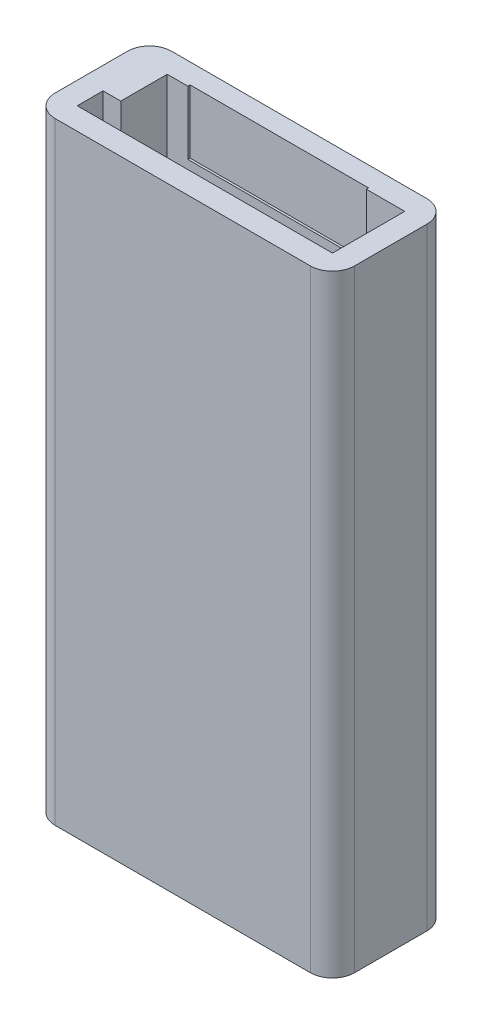
ISO-10303-21;
HEADER;
FILE_DESCRIPTION(('STEP AP214'),'2;1');
FILE_NAME('part.step','',(''),(''),'','','');
FILE_SCHEMA(('AUTOMOTIVE_DESIGN { 1 0 10303 214 1 1 1 1 }'));
ENDSEC;
DATA;
#1=APPLICATION_CONTEXT('core data for automotive mechanical design processes');
#2=APPLICATION_PROTOCOL_DEFINITION('international standard','automotive_design',2000,#1);
#3=PRODUCT_CONTEXT('',#1,'mechanical');
#4=PRODUCT('Part','Part','',(#3));
#5=PRODUCT_RELATED_PRODUCT_CATEGORY('part','',(#4));
#6=PRODUCT_DEFINITION_FORMATION('','',#4);
#7=PRODUCT_DEFINITION_CONTEXT('part definition',#1,'design');
#8=PRODUCT_DEFINITION('design','',#6,#7);
#9=PRODUCT_DEFINITION_SHAPE('','',#8);
#10=(LENGTH_UNIT() NAMED_UNIT(*) SI_UNIT(.MILLI.,.METRE.));
#11=(NAMED_UNIT(*) PLANE_ANGLE_UNIT() SI_UNIT($,.RADIAN.));
#12=(NAMED_UNIT(*) SI_UNIT($,.STERADIAN.) SOLID_ANGLE_UNIT());
#13=UNCERTAINTY_MEASURE_WITH_UNIT(LENGTH_MEASURE(1.E-05),#10,'distance_accuracy_value','');
#14=(GEOMETRIC_REPRESENTATION_CONTEXT(3) GLOBAL_UNCERTAINTY_ASSIGNED_CONTEXT((#13)) GLOBAL_UNIT_ASSIGNED_CONTEXT((#10,
#11,#12)) REPRESENTATION_CONTEXT('',''));
#15=CARTESIAN_POINT('',(0.,0.,0.));
#16=DIRECTION('',(0.,0.,1.));
#17=DIRECTION('',(1.,0.,0.));
#18=AXIS2_PLACEMENT_3D('',#15,#16,#17);
#19=CARTESIAN_POINT('',(8.65,41.5,-2.45));
#20=DIRECTION('',(0.,0.,1.));
#21=DIRECTION('',(1.,0.,0.));
#22=AXIS2_PLACEMENT_3D('',#19,#20,#21);
#23=PLANE('',#22);
#24=DIRECTION('',(0.,-1.,0.));
#25=VECTOR('',#24,1.);
#26=CARTESIAN_POINT('',(-6.05,41.5,-2.45));
#27=LINE('',#26,#25);
#28=CARTESIAN_POINT('',(-6.05,41.5,-2.45));
#29=VERTEX_POINT('',#28);
#30=CARTESIAN_POINT('',(-6.05,37.2,-2.45));
#31=VERTEX_POINT('',#30);
#32=EDGE_CURVE('E219',#29,#31,#27,.T.);
#33=ORIENTED_EDGE('',*,*,#32,.F.);
#34=DIRECTION('',(-1.,0.,0.));
#35=VECTOR('',#34,1.);
#36=CARTESIAN_POINT('',(8.65,41.5,-2.45));
#37=LINE('',#36,#35);
#38=CARTESIAN_POINT('',(-7.45,41.5,-2.45));
#39=VERTEX_POINT('',#38);
#40=EDGE_CURVE('E276',#29,#39,#37,.T.);
#41=ORIENTED_EDGE('',*,*,#40,.T.);
#42=DIRECTION('',(0.,-1.,0.));
#43=VECTOR('',#42,1.);
#44=CARTESIAN_POINT('',(-7.45,44.8708307581366,-2.45));
#45=LINE('',#44,#43);
#46=CARTESIAN_POINT('',(-7.45,1.5,-2.45));
#47=VERTEX_POINT('',#46);
#48=EDGE_CURVE('E256',#39,#47,#45,.T.);
#49=ORIENTED_EDGE('',*,*,#48,.T.);
#50=DIRECTION('',(-1.,0.,0.));
#51=VECTOR('',#50,1.);
#52=CARTESIAN_POINT('',(8.65,1.5,-2.45));
#53=LINE('',#52,#51);
#54=CARTESIAN_POINT('',(7.45,1.5,-2.45));
#55=VERTEX_POINT('',#54);
#56=EDGE_CURVE('E196',#55,#47,#53,.T.);
#57=ORIENTED_EDGE('',*,*,#56,.F.);
#58=DIRECTION('',(0.,-1.,0.));
#59=VECTOR('',#58,1.);
#60=CARTESIAN_POINT('',(7.45,18.5,-2.45));
#61=LINE('',#60,#59);
#62=CARTESIAN_POINT('',(7.45,18.5,-2.45));
#63=VERTEX_POINT('',#62);
#64=EDGE_CURVE('E241',#63,#55,#61,.T.);
#65=ORIENTED_EDGE('',*,*,#64,.F.);
#66=DIRECTION('',(-1.,0.,0.));
#67=VECTOR('',#66,1.);
#68=CARTESIAN_POINT('',(8.65,18.5,-2.45));
#69=LINE('',#68,#67);
#70=CARTESIAN_POINT('',(8.65,18.5,-2.45));
#71=VERTEX_POINT('',#70);
#72=EDGE_CURVE('E225',#71,#63,#69,.T.);
#73=ORIENTED_EDGE('',*,*,#72,.F.);
#74=DIRECTION('',(0.,-1.,0.));
#75=VECTOR('',#74,1.);
#76=CARTESIAN_POINT('',(8.65,41.5,-2.45));
#77=LINE('',#76,#75);
#78=CARTESIAN_POINT('',(8.65,41.5,-2.45));
#79=VERTEX_POINT('',#78);
#80=EDGE_CURVE('E279',#79,#71,#77,.T.);
#81=ORIENTED_EDGE('',*,*,#80,.F.);
#82=CARTESIAN_POINT('',(6.05,41.5,-2.45));
#83=VERTEX_POINT('',#82);
#84=EDGE_CURVE('E277',#79,#83,#37,.T.);
#85=ORIENTED_EDGE('',*,*,#84,.T.);
#86=DIRECTION('',(0.,1.,0.));
#87=VECTOR('',#86,1.);
#88=CARTESIAN_POINT('',(6.05,41.5,-2.45));
#89=LINE('',#88,#87);
#90=CARTESIAN_POINT('',(6.05,37.2,-2.45));
#91=VERTEX_POINT('',#90);
#92=EDGE_CURVE('E190',#91,#83,#89,.T.);
#93=ORIENTED_EDGE('',*,*,#92,.F.);
#94=DIRECTION('',(-1.,0.,0.));
#95=VECTOR('',#94,1.);
#96=CARTESIAN_POINT('',(8.65,37.2,-2.45));
#97=LINE('',#96,#95);
#98=EDGE_CURVE('E195',#91,#31,#97,.T.);
#99=ORIENTED_EDGE('',*,*,#98,.T.);
#100=EDGE_LOOP('',(#33,#41,#49,#57,#65,#73,#81,#85,#93,#99));
#101=FACE_BOUND('',#100,.T.);
#102=ADVANCED_FACE('F40',(#101),#23,.T.);
#103=CARTESIAN_POINT('',(0.,1.5,0.));
#104=DIRECTION('',(0.,1.,0.));
#105=DIRECTION('',(0.,0.,1.));
#106=AXIS2_PLACEMENT_3D('',#103,#104,#105);
#107=PLANE('',#106);
#108=DIRECTION('',(1.,0.,0.));
#109=VECTOR('',#108,1.);
#110=CARTESIAN_POINT('',(8.65,1.5,0.700000000000002));
#111=LINE('',#110,#109);
#112=CARTESIAN_POINT('',(7.45,1.5,0.700000000000002));
#113=VERTEX_POINT('',#112);
#114=CARTESIAN_POINT('',(8.65,1.5,0.700000000000002));
#115=VERTEX_POINT('',#114);
#116=EDGE_CURVE('E226',#113,#115,#111,.T.);
#117=ORIENTED_EDGE('',*,*,#116,.F.);
#118=DIRECTION('',(0.,0.,1.));
#119=VECTOR('',#118,1.);
#120=CARTESIAN_POINT('',(7.45,1.5,-2.45));
#121=LINE('',#120,#119);
#122=EDGE_CURVE('E222',#55,#113,#121,.T.);
#123=ORIENTED_EDGE('',*,*,#122,.F.);
#124=ORIENTED_EDGE('',*,*,#56,.T.);
#125=DIRECTION('',(0.,0.,-1.));
#126=VECTOR('',#125,1.);
#127=CARTESIAN_POINT('',(-7.45,1.5,-2.45));
#128=LINE('',#127,#126);
#129=CARTESIAN_POINT('',(-7.45,1.5,0.700000000000002));
#130=VERTEX_POINT('',#129);
#131=EDGE_CURVE('E253',#130,#47,#128,.T.);
#132=ORIENTED_EDGE('',*,*,#131,.F.);
#133=DIRECTION('',(1.,0.,0.));
#134=VECTOR('',#133,1.);
#135=CARTESIAN_POINT('',(-8.65,1.5,0.700000000000002));
#136=LINE('',#135,#134);
#137=CARTESIAN_POINT('',(-8.65,1.5,0.700000000000002));
#138=VERTEX_POINT('',#137);
#139=EDGE_CURVE('E243',#138,#130,#136,.T.);
#140=ORIENTED_EDGE('',*,*,#139,.F.);
#141=DIRECTION('',(0.,0.,1.));
#142=VECTOR('',#141,1.);
#143=CARTESIAN_POINT('',(-8.65,1.5,2.45));
#144=LINE('',#143,#142);
#145=CARTESIAN_POINT('',(-8.65,1.5,2.45));
#146=VERTEX_POINT('',#145);
#147=EDGE_CURVE('E267',#138,#146,#144,.T.);
#148=ORIENTED_EDGE('',*,*,#147,.T.);
#149=DIRECTION('',(1.,0.,0.));
#150=VECTOR('',#149,1.);
#151=CARTESIAN_POINT('',(8.65,1.5,2.45));
#152=LINE('',#151,#150);
#153=CARTESIAN_POINT('',(8.65,1.5,2.45));
#154=VERTEX_POINT('',#153);
#155=EDGE_CURVE('E264',#146,#154,#152,.T.);
#156=ORIENTED_EDGE('',*,*,#155,.T.);
#157=DIRECTION('',(0.,0.,-1.));
#158=VECTOR('',#157,1.);
#159=CARTESIAN_POINT('',(8.65,1.5,2.45));
#160=LINE('',#159,#158);
#161=EDGE_CURVE('E250',#154,#115,#160,.T.);
#162=ORIENTED_EDGE('',*,*,#161,.T.);
#163=EDGE_LOOP('',(#117,#123,#124,#132,#140,#148,#156,#162));
#164=FACE_BOUND('',#163,.T.);
#165=ADVANCED_FACE('F383',(#164),#107,.T.);
#166=CARTESIAN_POINT('',(8.65,41.5,2.45));
#167=DIRECTION('',(-1.,0.,0.));
#168=DIRECTION('',(0.,0.,1.));
#169=AXIS2_PLACEMENT_3D('',#166,#167,#168);
#170=PLANE('',#169);
#171=DIRECTION('',(0.,0.,-1.));
#172=VECTOR('',#171,1.);
#173=CARTESIAN_POINT('',(8.65,18.5,-2.45));
#174=LINE('',#173,#172);
#175=CARTESIAN_POINT('',(8.65,18.5,0.700000000000003));
#176=VERTEX_POINT('',#175);
#177=EDGE_CURVE('E223',#176,#71,#174,.T.);
#178=ORIENTED_EDGE('',*,*,#177,.F.);
#179=DIRECTION('',(0.,-1.,0.));
#180=VECTOR('',#179,1.);
#181=CARTESIAN_POINT('',(8.65,18.5,0.700000000000002));
#182=LINE('',#181,#180);
#183=EDGE_CURVE('E233',#176,#115,#182,.T.);
#184=ORIENTED_EDGE('',*,*,#183,.T.);
#185=ORIENTED_EDGE('',*,*,#161,.F.);
#186=DIRECTION('',(0.,-1.,0.));
#187=VECTOR('',#186,1.);
#188=CARTESIAN_POINT('',(8.65,41.5,2.45));
#189=LINE('',#188,#187);
#190=CARTESIAN_POINT('',(8.65,41.5,2.45));
#191=VERTEX_POINT('',#190);
#192=EDGE_CURVE('E282',#191,#154,#189,.T.);
#193=ORIENTED_EDGE('',*,*,#192,.F.);
#194=DIRECTION('',(0.,0.,-1.));
#195=VECTOR('',#194,1.);
#196=CARTESIAN_POINT('',(8.65,41.5,2.45));
#197=LINE('',#196,#195);
#198=EDGE_CURVE('E273',#191,#79,#197,.T.);
#199=ORIENTED_EDGE('',*,*,#198,.T.);
#200=ORIENTED_EDGE('',*,*,#80,.T.);
#201=EDGE_LOOP('',(#178,#184,#185,#193,#199,#200));
#202=FACE_BOUND('',#201,.T.);
#203=ADVANCED_FACE('F389',(#202),#170,.T.);
#204=CARTESIAN_POINT('',(-8.65,41.5,2.45));
#205=DIRECTION('',(1.,0.,0.));
#206=DIRECTION('',(0.,0.,-1.));
#207=AXIS2_PLACEMENT_3D('',#204,#205,#206);
#208=PLANE('',#207);
#209=ORIENTED_EDGE('',*,*,#147,.F.);
#210=DIRECTION('',(0.,-1.,0.));
#211=VECTOR('',#210,1.);
#212=CARTESIAN_POINT('',(-8.65,44.8708307581366,0.700000000000002));
#213=LINE('',#212,#211);
#214=CARTESIAN_POINT('',(-8.65,41.5,0.700000000000002));
#215=VERTEX_POINT('',#214);
#216=EDGE_CURVE('E248',#215,#138,#213,.T.);
#217=ORIENTED_EDGE('',*,*,#216,.F.);
#218=DIRECTION('',(0.,0.,1.));
#219=VECTOR('',#218,1.);
#220=CARTESIAN_POINT('',(-8.65,41.5,2.45));
#221=LINE('',#220,#219);
#222=CARTESIAN_POINT('',(-8.65,41.5,2.45));
#223=VERTEX_POINT('',#222);
#224=EDGE_CURVE('E269',#215,#223,#221,.T.);
#225=ORIENTED_EDGE('',*,*,#224,.T.);
#226=DIRECTION('',(0.,-1.,0.));
#227=VECTOR('',#226,1.);
#228=CARTESIAN_POINT('',(-8.65,41.5,2.45));
#229=LINE('',#228,#227);
#230=EDGE_CURVE('E285',#223,#146,#229,.T.);
#231=ORIENTED_EDGE('',*,*,#230,.T.);
#232=EDGE_LOOP('',(#209,#217,#225,#231));
#233=FACE_BOUND('',#232,.T.);
#234=ADVANCED_FACE('F397',(#233),#208,.T.);
#235=CARTESIAN_POINT('',(0.,41.5,0.));
#236=DIRECTION('',(0.,-1.,0.));
#237=DIRECTION('',(0.,0.,-1.));
#238=AXIS2_PLACEMENT_3D('',#235,#236,#237);
#239=PLANE('',#238);
#240=ORIENTED_EDGE('',*,*,#40,.F.);
#241=DIRECTION('',(0.,0.,1.));
#242=VECTOR('',#241,1.);
#243=CARTESIAN_POINT('',(-6.05,41.5,-2.3));
#244=LINE('',#243,#242);
#245=CARTESIAN_POINT('',(-6.05,41.5,-2.6));
#246=VERTEX_POINT('',#245);
#247=EDGE_CURVE('E211',#246,#29,#244,.T.);
#248=ORIENTED_EDGE('',*,*,#247,.F.);
#249=DIRECTION('',(-1.,0.,0.));
#250=VECTOR('',#249,1.);
#251=CARTESIAN_POINT('',(6.05,41.5,-2.6));
#252=LINE('',#251,#250);
#253=CARTESIAN_POINT('',(6.05,41.5,-2.6));
#254=VERTEX_POINT('',#253);
#255=EDGE_CURVE('E202',#254,#246,#252,.T.);
#256=ORIENTED_EDGE('',*,*,#255,.F.);
#257=DIRECTION('',(0.,0.,1.));
#258=VECTOR('',#257,1.);
#259=CARTESIAN_POINT('',(6.05,41.5,0.));
#260=LINE('',#259,#258);
#261=EDGE_CURVE('E184',#254,#83,#260,.T.);
#262=ORIENTED_EDGE('',*,*,#261,.T.);
#263=ORIENTED_EDGE('',*,*,#84,.F.);
#264=ORIENTED_EDGE('',*,*,#198,.F.);
#265=DIRECTION('',(1.,0.,0.));
#266=VECTOR('',#265,1.);
#267=CARTESIAN_POINT('',(8.65,41.5,2.45));
#268=LINE('',#267,#266);
#269=EDGE_CURVE('E271',#223,#191,#268,.T.);
#270=ORIENTED_EDGE('',*,*,#269,.F.);
#271=ORIENTED_EDGE('',*,*,#224,.F.);
#272=DIRECTION('',(-1.,0.,0.));
#273=VECTOR('',#272,1.);
#274=CARTESIAN_POINT('',(-8.65,41.5,0.700000000000002));
#275=LINE('',#274,#273);
#276=CARTESIAN_POINT('',(-7.45,41.5,0.700000000000002));
#277=VERTEX_POINT('',#276);
#278=EDGE_CURVE('E247',#277,#215,#275,.T.);
#279=ORIENTED_EDGE('',*,*,#278,.F.);
#280=DIRECTION('',(0.,0.,1.));
#281=VECTOR('',#280,1.);
#282=CARTESIAN_POINT('',(-7.45,41.5,-2.45));
#283=LINE('',#282,#281);
#284=EDGE_CURVE('E244',#39,#277,#283,.T.);
#285=ORIENTED_EDGE('',*,*,#284,.F.);
#286=EDGE_LOOP('',(#240,#248,#256,#262,#263,#264,#270,#271,#279,#285));
#287=FACE_BOUND('',#286,.T.);
#288=DIRECTION('',(-1.,0.,0.));
#289=VECTOR('',#288,1.);
#290=CARTESIAN_POINT('',(10.15,41.5,-3.95));
#291=LINE('',#290,#289);
#292=CARTESIAN_POINT('',(8.65,41.5,-3.95));
#293=VERTEX_POINT('',#292);
#294=CARTESIAN_POINT('',(-8.65,41.5,-3.95));
#295=VERTEX_POINT('',#294);
#296=EDGE_CURVE('E294',#293,#295,#291,.T.);
#297=ORIENTED_EDGE('',*,*,#296,.T.);
#298=CARTESIAN_POINT('',(-8.65,41.5,-2.45));
#299=DIRECTION('',(0.,-1.,0.));
#300=DIRECTION('',(0.,0.,-1.));
#301=AXIS2_PLACEMENT_3D('',#298,#299,#300);
#302=CIRCLE('',#301,1.5);
#303=CARTESIAN_POINT('',(-10.15,41.5,-2.45));
#304=VERTEX_POINT('',#303);
#305=EDGE_CURVE('E335',#295,#304,#302,.F.);
#306=ORIENTED_EDGE('',*,*,#305,.T.);
#307=DIRECTION('',(0.,0.,1.));
#308=VECTOR('',#307,1.);
#309=CARTESIAN_POINT('',(-10.15,41.5,3.95));
#310=LINE('',#309,#308);
#311=CARTESIAN_POINT('',(-10.15,41.5,2.45));
#312=VERTEX_POINT('',#311);
#313=EDGE_CURVE('E297',#304,#312,#310,.T.);
#314=ORIENTED_EDGE('',*,*,#313,.T.);
#315=CARTESIAN_POINT('',(-8.65,41.5,2.45));
#316=DIRECTION('',(0.,-1.,0.));
#317=DIRECTION('',(0.,0.,-1.));
#318=AXIS2_PLACEMENT_3D('',#315,#316,#317);
#319=CIRCLE('',#318,1.5);
#320=CARTESIAN_POINT('',(-8.65,41.5,3.95));
#321=VERTEX_POINT('',#320);
#322=EDGE_CURVE('E333',#312,#321,#319,.F.);
#323=ORIENTED_EDGE('',*,*,#322,.T.);
#324=DIRECTION('',(1.,0.,0.));
#325=VECTOR('',#324,1.);
#326=CARTESIAN_POINT('',(10.15,41.5,3.95));
#327=LINE('',#326,#325);
#328=CARTESIAN_POINT('',(8.65,41.5,3.95));
#329=VERTEX_POINT('',#328);
#330=EDGE_CURVE('E289',#321,#329,#327,.T.);
#331=ORIENTED_EDGE('',*,*,#330,.T.);
#332=CARTESIAN_POINT('',(8.65,41.5,2.45));
#333=DIRECTION('',(0.,-1.,0.));
#334=DIRECTION('',(0.,0.,-1.));
#335=AXIS2_PLACEMENT_3D('',#332,#333,#334);
#336=CIRCLE('',#335,1.5);
#337=CARTESIAN_POINT('',(10.15,41.5,2.45));
#338=VERTEX_POINT('',#337);
#339=EDGE_CURVE('E61',#329,#338,#336,.F.);
#340=ORIENTED_EDGE('',*,*,#339,.T.);
#341=DIRECTION('',(0.,0.,-1.));
#342=VECTOR('',#341,1.);
#343=CARTESIAN_POINT('',(10.15,41.5,3.95));
#344=LINE('',#343,#342);
#345=CARTESIAN_POINT('',(10.15,41.5,-2.45));
#346=VERTEX_POINT('',#345);
#347=EDGE_CURVE('E291',#338,#346,#344,.T.);
#348=ORIENTED_EDGE('',*,*,#347,.T.);
#349=CARTESIAN_POINT('',(8.65,41.5,-2.45));
#350=DIRECTION('',(0.,-1.,0.));
#351=DIRECTION('',(0.,0.,-1.));
#352=AXIS2_PLACEMENT_3D('',#349,#350,#351);
#353=CIRCLE('',#352,1.5);
#354=EDGE_CURVE('E330',#346,#293,#353,.F.);
#355=ORIENTED_EDGE('',*,*,#354,.T.);
#356=EDGE_LOOP('',(#297,#306,#314,#323,#331,#340,#348,#355));
#357=FACE_BOUND('',#356,.T.);
#358=ADVANCED_FACE('F210',(#287,#357),#239,.F.);
#359=CARTESIAN_POINT('',(0.,0.,0.));
#360=DIRECTION('',(0.,-1.,0.));
#361=DIRECTION('',(0.,0.,-1.));
#362=AXIS2_PLACEMENT_3D('',#359,#360,#361);
#363=PLANE('',#362);
#364=DIRECTION('',(0.,0.,1.));
#365=VECTOR('',#364,1.);
#366=CARTESIAN_POINT('',(-10.15,0.,3.95));
#367=LINE('',#366,#365);
#368=CARTESIAN_POINT('',(-10.15,0.,-2.45));
#369=VERTEX_POINT('',#368);
#370=CARTESIAN_POINT('',(-10.15,0.,2.45));
#371=VERTEX_POINT('',#370);
#372=EDGE_CURVE('E292',#369,#371,#367,.T.);
#373=ORIENTED_EDGE('',*,*,#372,.F.);
#374=CARTESIAN_POINT('',(-8.65,0.,-2.45));
#375=DIRECTION('',(0.,-1.,0.));
#376=DIRECTION('',(0.,0.,-1.));
#377=AXIS2_PLACEMENT_3D('',#374,#375,#376);
#378=CIRCLE('',#377,1.5);
#379=CARTESIAN_POINT('',(-8.65,0.,-3.95));
#380=VERTEX_POINT('',#379);
#381=EDGE_CURVE('E323',#369,#380,#378,.T.);
#382=ORIENTED_EDGE('',*,*,#381,.T.);
#383=DIRECTION('',(-1.,0.,0.));
#384=VECTOR('',#383,1.);
#385=CARTESIAN_POINT('',(10.15,0.,-3.95));
#386=LINE('',#385,#384);
#387=CARTESIAN_POINT('',(8.65,0.,-3.95));
#388=VERTEX_POINT('',#387);
#389=EDGE_CURVE('E304',#388,#380,#386,.T.);
#390=ORIENTED_EDGE('',*,*,#389,.F.);
#391=CARTESIAN_POINT('',(8.65,0.,-2.45));
#392=DIRECTION('',(0.,-1.,0.));
#393=DIRECTION('',(0.,0.,-1.));
#394=AXIS2_PLACEMENT_3D('',#391,#392,#393);
#395=CIRCLE('',#394,1.5);
#396=CARTESIAN_POINT('',(10.15,0.,-2.45));
#397=VERTEX_POINT('',#396);
#398=EDGE_CURVE('E317',#388,#397,#395,.T.);
#399=ORIENTED_EDGE('',*,*,#398,.T.);
#400=DIRECTION('',(0.,0.,-1.));
#401=VECTOR('',#400,1.);
#402=CARTESIAN_POINT('',(10.15,0.,3.95));
#403=LINE('',#402,#401);
#404=CARTESIAN_POINT('',(10.15,0.,2.45));
#405=VERTEX_POINT('',#404);
#406=EDGE_CURVE('E302',#405,#397,#403,.T.);
#407=ORIENTED_EDGE('',*,*,#406,.F.);
#408=CARTESIAN_POINT('',(8.65,0.,2.45));
#409=DIRECTION('',(0.,-1.,0.));
#410=DIRECTION('',(0.,0.,-1.));
#411=AXIS2_PLACEMENT_3D('',#408,#409,#410);
#412=CIRCLE('',#411,1.5);
#413=CARTESIAN_POINT('',(8.65,0.,3.95));
#414=VERTEX_POINT('',#413);
#415=EDGE_CURVE('E319',#405,#414,#412,.T.);
#416=ORIENTED_EDGE('',*,*,#415,.T.);
#417=DIRECTION('',(1.,0.,0.));
#418=VECTOR('',#417,1.);
#419=CARTESIAN_POINT('',(10.15,0.,3.95));
#420=LINE('',#419,#418);
#421=CARTESIAN_POINT('',(-8.65,0.,3.95));
#422=VERTEX_POINT('',#421);
#423=EDGE_CURVE('E288',#422,#414,#420,.T.);
#424=ORIENTED_EDGE('',*,*,#423,.F.);
#425=CARTESIAN_POINT('',(-8.65,0.,2.45));
#426=DIRECTION('',(0.,-1.,0.));
#427=DIRECTION('',(0.,0.,-1.));
#428=AXIS2_PLACEMENT_3D('',#425,#426,#427);
#429=CIRCLE('',#428,1.5);
#430=EDGE_CURVE('E321',#422,#371,#429,.T.);
#431=ORIENTED_EDGE('',*,*,#430,.T.);
#432=EDGE_LOOP('',(#373,#382,#390,#399,#407,#416,#424,#431));
#433=FACE_BOUND('',#432,.T.);
#434=ADVANCED_FACE('F351',(#433),#363,.T.);
#435=CARTESIAN_POINT('',(10.15,41.5,3.95));
#436=DIRECTION('',(0.,0.,-1.));
#437=DIRECTION('',(-1.,0.,0.));
#438=AXIS2_PLACEMENT_3D('',#435,#436,#437);
#439=PLANE('',#438);
#440=ORIENTED_EDGE('',*,*,#330,.F.);
#441=DIRECTION('',(0.,-1.,0.));
#442=VECTOR('',#441,1.);
#443=CARTESIAN_POINT('',(-8.65,41.5,3.95));
#444=LINE('',#443,#442);
#445=EDGE_CURVE('E339',#321,#422,#444,.T.);
#446=ORIENTED_EDGE('',*,*,#445,.T.);
#447=ORIENTED_EDGE('',*,*,#423,.T.);
#448=DIRECTION('',(0.,-1.,0.));
#449=VECTOR('',#448,1.);
#450=CARTESIAN_POINT('',(8.65,41.5,3.95));
#451=LINE('',#450,#449);
#452=EDGE_CURVE('E337',#414,#329,#451,.F.);
#453=ORIENTED_EDGE('',*,*,#452,.T.);
#454=EDGE_LOOP('',(#440,#446,#447,#453));
#455=FACE_BOUND('',#454,.T.);
#456=ADVANCED_FACE('F345',(#455),#439,.F.);
#457=CARTESIAN_POINT('',(10.15,41.5,3.95));
#458=DIRECTION('',(-1.,0.,0.));
#459=DIRECTION('',(0.,0.,1.));
#460=AXIS2_PLACEMENT_3D('',#457,#458,#459);
#461=PLANE('',#460);
#462=ORIENTED_EDGE('',*,*,#347,.F.);
#463=DIRECTION('',(0.,-1.,0.));
#464=VECTOR('',#463,1.);
#465=CARTESIAN_POINT('',(10.15,41.5,2.45));
#466=LINE('',#465,#464);
#467=EDGE_CURVE('E13',#338,#405,#466,.T.);
#468=ORIENTED_EDGE('',*,*,#467,.T.);
#469=ORIENTED_EDGE('',*,*,#406,.T.);
#470=DIRECTION('',(0.,-1.,0.));
#471=VECTOR('',#470,1.);
#472=CARTESIAN_POINT('',(10.15,41.5,-2.45));
#473=LINE('',#472,#471);
#474=EDGE_CURVE('E48',#397,#346,#473,.F.);
#475=ORIENTED_EDGE('',*,*,#474,.T.);
#476=EDGE_LOOP('',(#462,#468,#469,#475));
#477=FACE_BOUND('',#476,.T.);
#478=ADVANCED_FACE('F356',(#477),#461,.F.);
#479=CARTESIAN_POINT('',(10.15,41.5,-3.95));
#480=DIRECTION('',(0.,0.,1.));
#481=DIRECTION('',(1.,0.,0.));
#482=AXIS2_PLACEMENT_3D('',#479,#480,#481);
#483=PLANE('',#482);
#484=ORIENTED_EDGE('',*,*,#389,.T.);
#485=DIRECTION('',(0.,-1.,0.));
#486=VECTOR('',#485,1.);
#487=CARTESIAN_POINT('',(-8.65,41.5,-3.95));
#488=LINE('',#487,#486);
#489=EDGE_CURVE('E328',#380,#295,#488,.F.);
#490=ORIENTED_EDGE('',*,*,#489,.T.);
#491=ORIENTED_EDGE('',*,*,#296,.F.);
#492=DIRECTION('',(0.,-1.,0.));
#493=VECTOR('',#492,1.);
#494=CARTESIAN_POINT('',(8.65,41.5,-3.95));
#495=LINE('',#494,#493);
#496=EDGE_CURVE('E325',#293,#388,#495,.T.);
#497=ORIENTED_EDGE('',*,*,#496,.T.);
#498=EDGE_LOOP('',(#484,#490,#491,#497));
#499=FACE_BOUND('',#498,.T.);
#500=ADVANCED_FACE('F363',(#499),#483,.F.);
#501=CARTESIAN_POINT('',(-10.15,41.5,3.95));
#502=DIRECTION('',(1.,0.,0.));
#503=DIRECTION('',(0.,0.,-1.));
#504=AXIS2_PLACEMENT_3D('',#501,#502,#503);
#505=PLANE('',#504);
#506=ORIENTED_EDGE('',*,*,#313,.F.);
#507=DIRECTION('',(0.,-1.,0.));
#508=VECTOR('',#507,1.);
#509=CARTESIAN_POINT('',(-10.15,41.5,-2.45));
#510=LINE('',#509,#508);
#511=EDGE_CURVE('E314',#304,#369,#510,.T.);
#512=ORIENTED_EDGE('',*,*,#511,.T.);
#513=ORIENTED_EDGE('',*,*,#372,.T.);
#514=DIRECTION('',(0.,-1.,0.));
#515=VECTOR('',#514,1.);
#516=CARTESIAN_POINT('',(-10.15,41.5,2.45));
#517=LINE('',#516,#515);
#518=EDGE_CURVE('E312',#371,#312,#517,.F.);
#519=ORIENTED_EDGE('',*,*,#518,.T.);
#520=EDGE_LOOP('',(#506,#512,#513,#519));
#521=FACE_BOUND('',#520,.T.);
#522=ADVANCED_FACE('F371',(#521),#505,.F.);
#523=CARTESIAN_POINT('',(8.65,41.5,2.45));
#524=DIRECTION('',(0.,0.,-1.));
#525=DIRECTION('',(-1.,0.,0.));
#526=AXIS2_PLACEMENT_3D('',#523,#524,#525);
#527=PLANE('',#526);
#528=ORIENTED_EDGE('',*,*,#155,.F.);
#529=ORIENTED_EDGE('',*,*,#230,.F.);
#530=ORIENTED_EDGE('',*,*,#269,.T.);
#531=ORIENTED_EDGE('',*,*,#192,.T.);
#532=EDGE_LOOP('',(#528,#529,#530,#531));
#533=FACE_BOUND('',#532,.T.);
#534=ADVANCED_FACE('F399',(#533),#527,.T.);
#535=CARTESIAN_POINT('',(-7.45,44.8708307581366,-2.45));
#536=DIRECTION('',(-1.,0.,0.));
#537=DIRECTION('',(0.,0.,1.));
#538=AXIS2_PLACEMENT_3D('',#535,#536,#537);
#539=PLANE('',#538);
#540=ORIENTED_EDGE('',*,*,#48,.F.);
#541=ORIENTED_EDGE('',*,*,#284,.T.);
#542=DIRECTION('',(0.,-1.,0.));
#543=VECTOR('',#542,1.);
#544=CARTESIAN_POINT('',(-7.45,44.8708307581366,0.700000000000002));
#545=LINE('',#544,#543);
#546=EDGE_CURVE('E259',#277,#130,#545,.T.);
#547=ORIENTED_EDGE('',*,*,#546,.T.);
#548=ORIENTED_EDGE('',*,*,#131,.T.);
#549=EDGE_LOOP('',(#540,#541,#547,#548));
#550=FACE_BOUND('',#549,.T.);
#551=ADVANCED_FACE('F402',(#550),#539,.F.);
#552=CARTESIAN_POINT('',(-8.65,44.8708307581366,0.700000000000002));
#553=DIRECTION('',(0.,0.,-1.));
#554=DIRECTION('',(-1.,0.,0.));
#555=AXIS2_PLACEMENT_3D('',#552,#553,#554);
#556=PLANE('',#555);
#557=ORIENTED_EDGE('',*,*,#546,.F.);
#558=ORIENTED_EDGE('',*,*,#278,.T.);
#559=ORIENTED_EDGE('',*,*,#216,.T.);
#560=ORIENTED_EDGE('',*,*,#139,.T.);
#561=EDGE_LOOP('',(#557,#558,#559,#560));
#562=FACE_BOUND('',#561,.T.);
#563=ADVANCED_FACE('F446',(#562),#556,.F.);
#564=CARTESIAN_POINT('',(7.45,18.5,-2.45));
#565=DIRECTION('',(1.,0.,0.));
#566=DIRECTION('',(0.,0.,-1.));
#567=AXIS2_PLACEMENT_3D('',#564,#565,#566);
#568=PLANE('',#567);
#569=ORIENTED_EDGE('',*,*,#122,.T.);
#570=DIRECTION('',(0.,-1.,0.));
#571=VECTOR('',#570,1.);
#572=CARTESIAN_POINT('',(7.45,18.5,0.700000000000002));
#573=LINE('',#572,#571);
#574=CARTESIAN_POINT('',(7.45,18.5,0.700000000000002));
#575=VERTEX_POINT('',#574);
#576=EDGE_CURVE('E238',#575,#113,#573,.T.);
#577=ORIENTED_EDGE('',*,*,#576,.F.);
#578=DIRECTION('',(0.,0.,1.));
#579=VECTOR('',#578,1.);
#580=CARTESIAN_POINT('',(7.45,18.5,-2.45));
#581=LINE('',#580,#579);
#582=EDGE_CURVE('E228',#63,#575,#581,.T.);
#583=ORIENTED_EDGE('',*,*,#582,.F.);
#584=ORIENTED_EDGE('',*,*,#64,.T.);
#585=EDGE_LOOP('',(#569,#577,#583,#584));
#586=FACE_BOUND('',#585,.T.);
#587=ADVANCED_FACE('F454',(#586),#568,.F.);
#588=CARTESIAN_POINT('',(8.65,18.5,0.700000000000002));
#589=DIRECTION('',(0.,0.,-1.));
#590=DIRECTION('',(-1.,0.,0.));
#591=AXIS2_PLACEMENT_3D('',#588,#589,#590);
#592=PLANE('',#591);
#593=ORIENTED_EDGE('',*,*,#116,.T.);
#594=ORIENTED_EDGE('',*,*,#183,.F.);
#595=DIRECTION('',(1.,0.,0.));
#596=VECTOR('',#595,1.);
#597=CARTESIAN_POINT('',(8.65,18.5,0.700000000000002));
#598=LINE('',#597,#596);
#599=EDGE_CURVE('E230',#575,#176,#598,.T.);
#600=ORIENTED_EDGE('',*,*,#599,.F.);
#601=ORIENTED_EDGE('',*,*,#576,.T.);
#602=EDGE_LOOP('',(#593,#594,#600,#601));
#603=FACE_BOUND('',#602,.T.);
#604=ADVANCED_FACE('F462',(#603),#592,.F.);
#605=CARTESIAN_POINT('',(0.,18.5,0.));
#606=DIRECTION('',(0.,-1.,0.));
#607=DIRECTION('',(0.,0.,-1.));
#608=AXIS2_PLACEMENT_3D('',#605,#606,#607);
#609=PLANE('',#608);
#610=ORIENTED_EDGE('',*,*,#177,.T.);
#611=ORIENTED_EDGE('',*,*,#72,.T.);
#612=ORIENTED_EDGE('',*,*,#582,.T.);
#613=ORIENTED_EDGE('',*,*,#599,.T.);
#614=EDGE_LOOP('',(#610,#611,#612,#613));
#615=FACE_BOUND('',#614,.T.);
#616=ADVANCED_FACE('F471',(#615),#609,.F.);
#617=CARTESIAN_POINT('',(-6.05,-10.6037184369102,-2.3));
#618=DIRECTION('',(-1.,0.,0.));
#619=DIRECTION('',(0.,0.,1.));
#620=AXIS2_PLACEMENT_3D('',#617,#618,#619);
#621=PLANE('',#620);
#622=ORIENTED_EDGE('',*,*,#32,.T.);
#623=DIRECTION('',(0.,0.,-1.));
#624=VECTOR('',#623,1.);
#625=CARTESIAN_POINT('',(-6.05,37.2,-2.3));
#626=LINE('',#625,#624);
#627=CARTESIAN_POINT('',(-6.05,37.2,-2.6));
#628=VERTEX_POINT('',#627);
#629=EDGE_CURVE('E220',#31,#628,#626,.T.);
#630=ORIENTED_EDGE('',*,*,#629,.T.);
#631=DIRECTION('',(0.,1.,0.));
#632=VECTOR('',#631,1.);
#633=CARTESIAN_POINT('',(-6.05,-10.6037184369102,-2.6));
#634=LINE('',#633,#632);
#635=EDGE_CURVE('E207',#628,#246,#634,.T.);
#636=ORIENTED_EDGE('',*,*,#635,.T.);
#637=ORIENTED_EDGE('',*,*,#247,.T.);
#638=EDGE_LOOP('',(#622,#630,#636,#637));
#639=FACE_BOUND('',#638,.T.);
#640=ADVANCED_FACE('F479',(#639),#621,.F.);
#641=CARTESIAN_POINT('',(6.05,-10.6037184369102,-2.6));
#642=DIRECTION('',(0.,0.,-1.));
#643=DIRECTION('',(-1.,0.,0.));
#644=AXIS2_PLACEMENT_3D('',#641,#642,#643);
#645=PLANE('',#644);
#646=DIRECTION('',(1.,0.,0.));
#647=VECTOR('',#646,1.);
#648=CARTESIAN_POINT('',(6.05,37.2,-2.6));
#649=LINE('',#648,#647);
#650=CARTESIAN_POINT('',(6.05,37.2,-2.6));
#651=VERTEX_POINT('',#650);
#652=EDGE_CURVE('E205',#628,#651,#649,.T.);
#653=ORIENTED_EDGE('',*,*,#652,.T.);
#654=DIRECTION('',(0.,1.,0.));
#655=VECTOR('',#654,1.);
#656=CARTESIAN_POINT('',(6.05,-10.6037184369102,-2.6));
#657=LINE('',#656,#655);
#658=EDGE_CURVE('E188',#651,#254,#657,.T.);
#659=ORIENTED_EDGE('',*,*,#658,.T.);
#660=ORIENTED_EDGE('',*,*,#255,.T.);
#661=ORIENTED_EDGE('',*,*,#635,.F.);
#662=EDGE_LOOP('',(#653,#659,#660,#661));
#663=FACE_BOUND('',#662,.T.);
#664=ADVANCED_FACE('F200',(#663),#645,.F.);
#665=CARTESIAN_POINT('',(6.05,-10.6037184369102,-2.3));
#666=DIRECTION('',(1.,0.,0.));
#667=DIRECTION('',(0.,0.,-1.));
#668=AXIS2_PLACEMENT_3D('',#665,#666,#667);
#669=PLANE('',#668);
#670=ORIENTED_EDGE('',*,*,#92,.T.);
#671=ORIENTED_EDGE('',*,*,#261,.F.);
#672=ORIENTED_EDGE('',*,*,#658,.F.);
#673=DIRECTION('',(0.,0.,1.));
#674=VECTOR('',#673,1.);
#675=CARTESIAN_POINT('',(6.05,37.2,-2.3));
#676=LINE('',#675,#674);
#677=EDGE_CURVE('E216',#651,#91,#676,.T.);
#678=ORIENTED_EDGE('',*,*,#677,.T.);
#679=EDGE_LOOP('',(#670,#671,#672,#678));
#680=FACE_BOUND('',#679,.T.);
#681=ADVANCED_FACE('F186',(#680),#669,.F.);
#682=CARTESIAN_POINT('',(0.,37.2,0.));
#683=DIRECTION('',(0.,1.,0.));
#684=DIRECTION('',(0.,0.,1.));
#685=AXIS2_PLACEMENT_3D('',#682,#683,#684);
#686=PLANE('',#685);
#687=ORIENTED_EDGE('',*,*,#677,.F.);
#688=ORIENTED_EDGE('',*,*,#652,.F.);
#689=ORIENTED_EDGE('',*,*,#629,.F.);
#690=ORIENTED_EDGE('',*,*,#98,.F.);
#691=EDGE_LOOP('',(#687,#688,#689,#690));
#692=FACE_BOUND('',#691,.T.);
#693=ADVANCED_FACE('F380',(#692),#686,.T.);
#694=CARTESIAN_POINT('',(-8.65,41.5,-2.45));
#695=DIRECTION('',(0.,-1.,0.));
#696=DIRECTION('',(0.,0.,-1.));
#697=AXIS2_PLACEMENT_3D('',#694,#695,#696);
#698=CYLINDRICAL_SURFACE('',#697,1.5);
#699=ORIENTED_EDGE('',*,*,#305,.F.);
#700=ORIENTED_EDGE('',*,*,#489,.F.);
#701=ORIENTED_EDGE('',*,*,#381,.F.);
#702=ORIENTED_EDGE('',*,*,#511,.F.);
#703=EDGE_LOOP('',(#699,#700,#701,#702));
#704=FACE_BOUND('',#703,.T.);
#705=ADVANCED_FACE('F368',(#704),#698,.T.);
#706=CARTESIAN_POINT('',(-8.65,41.5,2.45));
#707=DIRECTION('',(0.,-1.,0.));
#708=DIRECTION('',(0.,0.,-1.));
#709=AXIS2_PLACEMENT_3D('',#706,#707,#708);
#710=CYLINDRICAL_SURFACE('',#709,1.5);
#711=ORIENTED_EDGE('',*,*,#322,.F.);
#712=ORIENTED_EDGE('',*,*,#518,.F.);
#713=ORIENTED_EDGE('',*,*,#430,.F.);
#714=ORIENTED_EDGE('',*,*,#445,.F.);
#715=EDGE_LOOP('',(#711,#712,#713,#714));
#716=FACE_BOUND('',#715,.T.);
#717=ADVANCED_FACE('F373',(#716),#710,.T.);
#718=CARTESIAN_POINT('',(8.65,41.5,2.45));
#719=DIRECTION('',(0.,-1.,0.));
#720=DIRECTION('',(0.,0.,-1.));
#721=AXIS2_PLACEMENT_3D('',#718,#719,#720);
#722=CYLINDRICAL_SURFACE('',#721,1.5);
#723=ORIENTED_EDGE('',*,*,#339,.F.);
#724=ORIENTED_EDGE('',*,*,#452,.F.);
#725=ORIENTED_EDGE('',*,*,#415,.F.);
#726=ORIENTED_EDGE('',*,*,#467,.F.);
#727=EDGE_LOOP('',(#723,#724,#725,#726));
#728=FACE_BOUND('',#727,.T.);
#729=ADVANCED_FACE('F355',(#728),#722,.T.);
#730=CARTESIAN_POINT('',(8.65,41.5,-2.45));
#731=DIRECTION('',(0.,-1.,0.));
#732=DIRECTION('',(0.,0.,-1.));
#733=AXIS2_PLACEMENT_3D('',#730,#731,#732);
#734=CYLINDRICAL_SURFACE('',#733,1.5);
#735=ORIENTED_EDGE('',*,*,#354,.F.);
#736=ORIENTED_EDGE('',*,*,#474,.F.);
#737=ORIENTED_EDGE('',*,*,#398,.F.);
#738=ORIENTED_EDGE('',*,*,#496,.F.);
#739=EDGE_LOOP('',(#735,#736,#737,#738));
#740=FACE_BOUND('',#739,.T.);
#741=ADVANCED_FACE('F42',(#740),#734,.T.);
#742=CLOSED_SHELL('',(#102,#165,#203,#234,#358,#434,#456,#478,#500,#522,#534,#551,#563,#587,
#604,#616,#640,#664,#681,#693,#705,#717,#729,#741));
#743=MANIFOLD_SOLID_BREP('B2',#742);
#744=ADVANCED_BREP_SHAPE_REPRESENTATION('',(#18,#743),#14);
#745=SHAPE_DEFINITION_REPRESENTATION(#9,#744);
ENDSEC;
END-ISO-10303-21;
